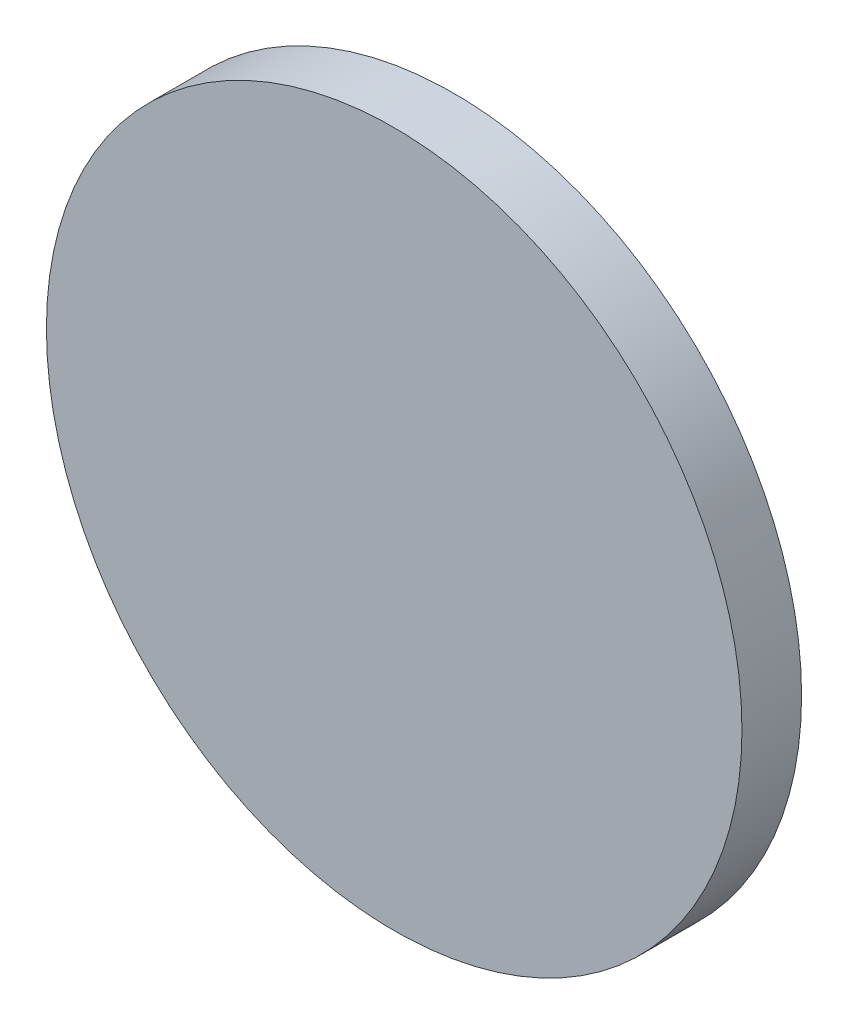
ISO-10303-21;
HEADER;
FILE_DESCRIPTION(('STEP AP214'),'2;1');
FILE_NAME('part.step','',(''),(''),'','','');
FILE_SCHEMA(('AUTOMOTIVE_DESIGN { 1 0 10303 214 1 1 1 1 }'));
ENDSEC;
DATA;
#1=APPLICATION_CONTEXT('core data for automotive mechanical design processes');
#2=APPLICATION_PROTOCOL_DEFINITION('international standard','automotive_design',2000,#1);
#3=PRODUCT_CONTEXT('',#1,'mechanical');
#4=PRODUCT('Part','Part','',(#3));
#5=PRODUCT_RELATED_PRODUCT_CATEGORY('part','',(#4));
#6=PRODUCT_DEFINITION_FORMATION('','',#4);
#7=PRODUCT_DEFINITION_CONTEXT('part definition',#1,'design');
#8=PRODUCT_DEFINITION('design','',#6,#7);
#9=PRODUCT_DEFINITION_SHAPE('','',#8);
#10=(LENGTH_UNIT() NAMED_UNIT(*) SI_UNIT(.MILLI.,.METRE.));
#11=(NAMED_UNIT(*) PLANE_ANGLE_UNIT() SI_UNIT($,.RADIAN.));
#12=(NAMED_UNIT(*) SI_UNIT($,.STERADIAN.) SOLID_ANGLE_UNIT());
#13=UNCERTAINTY_MEASURE_WITH_UNIT(LENGTH_MEASURE(1.E-05),#10,'distance_accuracy_value','');
#14=(GEOMETRIC_REPRESENTATION_CONTEXT(3) GLOBAL_UNCERTAINTY_ASSIGNED_CONTEXT((#13)) GLOBAL_UNIT_ASSIGNED_CONTEXT((#10,
#11,#12)) REPRESENTATION_CONTEXT('',''));
#15=CARTESIAN_POINT('',(0.,0.,0.));
#16=DIRECTION('',(0.,0.,1.));
#17=DIRECTION('',(1.,0.,0.));
#18=AXIS2_PLACEMENT_3D('',#15,#16,#17);
#19=CARTESIAN_POINT('',(11.428,3.748000014875,0.76487));
#20=DIRECTION('',(0.,0.,-1.));
#21=DIRECTION('',(-1.,0.,0.));
#22=AXIS2_PLACEMENT_3D('',#19,#20,#21);
#23=PLANE('',#22);
#24=CARTESIAN_POINT('',(11.428,3.748000014875,0.76487));
#25=DIRECTION('',(0.,0.,1.));
#26=DIRECTION('',(1.,0.,0.));
#27=AXIS2_PLACEMENT_3D('',#24,#25,#26);
#28=CIRCLE('',#27,0.200024667);
#29=CARTESIAN_POINT('',(11.628024667,3.748000014875,0.76487));
#30=VERTEX_POINT('',#29);
#31=EDGE_CURVE('E18',#30,#30,#28,.T.);
#32=ORIENTED_EDGE('',*,*,#31,.F.);
#33=EDGE_LOOP('',(#32));
#34=FACE_BOUND('',#33,.T.);
#35=ADVANCED_FACE('F15',(#34),#23,.T.);
#36=CARTESIAN_POINT('',(11.428,3.748000014875,0.76487));
#37=DIRECTION('',(0.,0.,1.));
#38=DIRECTION('',(1.,0.,0.));
#39=AXIS2_PLACEMENT_3D('',#36,#37,#38);
#40=CYLINDRICAL_SURFACE('',#39,0.200024667);
#41=CARTESIAN_POINT('',(11.428,3.748000014875,0.79916));
#42=DIRECTION('',(0.,0.,1.));
#43=DIRECTION('',(1.,0.,0.));
#44=AXIS2_PLACEMENT_3D('',#41,#42,#43);
#45=CIRCLE('',#44,0.200024667);
#46=CARTESIAN_POINT('',(11.628024667,3.748000014875,0.79916));
#47=VERTEX_POINT('',#46);
#48=EDGE_CURVE('E10',#47,#47,#45,.T.);
#49=ORIENTED_EDGE('',*,*,#48,.F.);
#50=EDGE_LOOP('',(#49));
#51=FACE_BOUND('',#50,.T.);
#52=ORIENTED_EDGE('',*,*,#31,.T.);
#53=EDGE_LOOP('',(#52));
#54=FACE_BOUND('',#53,.T.);
#55=ADVANCED_FACE('F27',(#51,#54),#40,.T.);
#56=CARTESIAN_POINT('',(11.428,3.748000014875,0.79916));
#57=DIRECTION('',(0.,0.,1.));
#58=DIRECTION('',(1.,0.,0.));
#59=AXIS2_PLACEMENT_3D('',#56,#57,#58);
#60=PLANE('',#59);
#61=ORIENTED_EDGE('',*,*,#48,.T.);
#62=EDGE_LOOP('',(#61));
#63=FACE_BOUND('',#62,.T.);
#64=ADVANCED_FACE('F34',(#63),#60,.T.);
#65=CLOSED_SHELL('',(#35,#55,#64));
#66=MANIFOLD_SOLID_BREP('B1',#65);
#67=ADVANCED_BREP_SHAPE_REPRESENTATION('',(#18,#66),#14);
#68=SHAPE_DEFINITION_REPRESENTATION(#9,#67);
ENDSEC;
END-ISO-10303-21;
